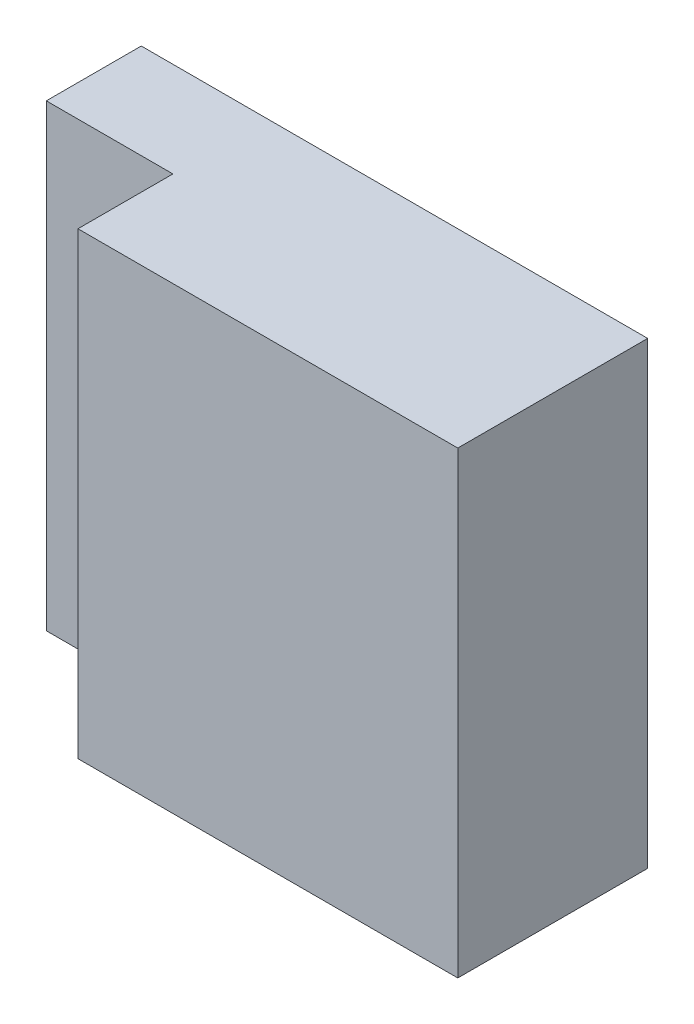
ISO-10303-21;
HEADER;
FILE_DESCRIPTION(('STEP AP214'),'2;1');
FILE_NAME('part.step','',(''),(''),'','','');
FILE_SCHEMA(('AUTOMOTIVE_DESIGN { 1 0 10303 214 1 1 1 1 }'));
ENDSEC;
DATA;
#1=APPLICATION_CONTEXT('core data for automotive mechanical design processes');
#2=APPLICATION_PROTOCOL_DEFINITION('international standard','automotive_design',2000,#1);
#3=PRODUCT_CONTEXT('',#1,'mechanical');
#4=PRODUCT('Part','Part','',(#3));
#5=PRODUCT_RELATED_PRODUCT_CATEGORY('part','',(#4));
#6=PRODUCT_DEFINITION_FORMATION('','',#4);
#7=PRODUCT_DEFINITION_CONTEXT('part definition',#1,'design');
#8=PRODUCT_DEFINITION('design','',#6,#7);
#9=PRODUCT_DEFINITION_SHAPE('','',#8);
#10=(LENGTH_UNIT() NAMED_UNIT(*) SI_UNIT(.MILLI.,.METRE.));
#11=(NAMED_UNIT(*) PLANE_ANGLE_UNIT() SI_UNIT($,.RADIAN.));
#12=(NAMED_UNIT(*) SI_UNIT($,.STERADIAN.) SOLID_ANGLE_UNIT());
#13=UNCERTAINTY_MEASURE_WITH_UNIT(LENGTH_MEASURE(1.E-05),#10,'distance_accuracy_value','');
#14=(GEOMETRIC_REPRESENTATION_CONTEXT(3) GLOBAL_UNCERTAINTY_ASSIGNED_CONTEXT((#13)) GLOBAL_UNIT_ASSIGNED_CONTEXT((#10,
#11,#12)) REPRESENTATION_CONTEXT('',''));
#15=CARTESIAN_POINT('',(0.,0.,0.));
#16=DIRECTION('',(0.,0.,1.));
#17=DIRECTION('',(1.,0.,0.));
#18=AXIS2_PLACEMENT_3D('',#15,#16,#17);
#19=CARTESIAN_POINT('',(0.7,0.,0.65));
#20=DIRECTION('',(1.,0.,0.));
#21=DIRECTION('',(0.,0.,-1.));
#22=AXIS2_PLACEMENT_3D('',#19,#20,#21);
#23=PLANE('',#22);
#24=DIRECTION('',(0.,0.,-1.));
#25=VECTOR('',#24,1.);
#26=CARTESIAN_POINT('',(0.7,1.450000047684,0.65));
#27=LINE('',#26,#25);
#28=CARTESIAN_POINT('',(0.7,1.450000047684,0.65000000447025));
#29=VERTEX_POINT('',#28);
#30=CARTESIAN_POINT('',(0.7,1.450000047684,0.950000011921));
#31=VERTEX_POINT('',#30);
#32=EDGE_CURVE('E71',#29,#31,#27,.F.);
#33=ORIENTED_EDGE('',*,*,#32,.F.);
#34=DIRECTION('',(0.,1.,0.));
#35=VECTOR('',#34,1.);
#36=CARTESIAN_POINT('',(0.7,0.,0.650000011921));
#37=LINE('',#36,#35);
#38=CARTESIAN_POINT('',(0.7,0.,0.65000000447025));
#39=VERTEX_POINT('',#38);
#40=EDGE_CURVE('E72',#39,#29,#37,.T.);
#41=ORIENTED_EDGE('',*,*,#40,.F.);
#42=DIRECTION('',(0.,0.,-1.));
#43=VECTOR('',#42,1.);
#44=CARTESIAN_POINT('',(0.7,0.,0.65));
#45=LINE('',#44,#43);
#46=CARTESIAN_POINT('',(0.7,0.,0.950000011921));
#47=VERTEX_POINT('',#46);
#48=EDGE_CURVE('E19',#47,#39,#45,.T.);
#49=ORIENTED_EDGE('',*,*,#48,.F.);
#50=DIRECTION('',(0.,1.,0.));
#51=VECTOR('',#50,1.);
#52=CARTESIAN_POINT('',(0.7,0.,0.950000011921));
#53=LINE('',#52,#51);
#54=EDGE_CURVE('E74',#31,#47,#53,.F.);
#55=ORIENTED_EDGE('',*,*,#54,.F.);
#56=EDGE_LOOP('',(#33,#41,#49,#55));
#57=FACE_BOUND('',#56,.T.);
#58=ADVANCED_FACE('F16',(#57),#23,.F.);
#59=CARTESIAN_POINT('',(0.7,0.,0.950000011921));
#60=DIRECTION('',(0.,0.,1.));
#61=DIRECTION('',(1.,0.,0.));
#62=AXIS2_PLACEMENT_3D('',#59,#60,#61);
#63=PLANE('',#62);
#64=DIRECTION('',(0.,1.,0.));
#65=VECTOR('',#64,1.);
#66=CARTESIAN_POINT('',(1.900000047684,0.,0.950000011921));
#67=LINE('',#66,#65);
#68=CARTESIAN_POINT('',(1.900000047684,1.450000047684,0.950000011921));
#69=VERTEX_POINT('',#68);
#70=CARTESIAN_POINT('',(1.900000047684,0.,0.950000011921));
#71=VERTEX_POINT('',#70);
#72=EDGE_CURVE('E92',#69,#71,#67,.F.);
#73=ORIENTED_EDGE('',*,*,#72,.F.);
#74=DIRECTION('',(1.,0.,0.));
#75=VECTOR('',#74,1.);
#76=CARTESIAN_POINT('',(0.7,1.450000047684,0.950000011921));
#77=LINE('',#76,#75);
#78=EDGE_CURVE('E95',#31,#69,#77,.T.);
#79=ORIENTED_EDGE('',*,*,#78,.F.);
#80=ORIENTED_EDGE('',*,*,#54,.T.);
#81=DIRECTION('',(1.,0.,0.));
#82=VECTOR('',#81,1.);
#83=CARTESIAN_POINT('',(0.7,0.,0.950000011921));
#84=LINE('',#83,#82);
#85=EDGE_CURVE('E80',#47,#71,#84,.T.);
#86=ORIENTED_EDGE('',*,*,#85,.T.);
#87=EDGE_LOOP('',(#73,#79,#80,#86));
#88=FACE_BOUND('',#87,.T.);
#89=ADVANCED_FACE('F132',(#88),#63,.T.);
#90=CARTESIAN_POINT('',(0.3,0.,0.650000011921));
#91=DIRECTION('',(0.,0.,1.));
#92=DIRECTION('',(1.,0.,0.));
#93=AXIS2_PLACEMENT_3D('',#90,#91,#92);
#94=PLANE('',#93);
#95=DIRECTION('',(1.,0.,0.));
#96=VECTOR('',#95,1.);
#97=CARTESIAN_POINT('',(0.3,0.,0.650000011921));
#98=LINE('',#97,#96);
#99=CARTESIAN_POINT('',(0.3,0.,0.650000011921));
#100=VERTEX_POINT('',#99);
#101=EDGE_CURVE('E65',#100,#39,#98,.T.);
#102=ORIENTED_EDGE('',*,*,#101,.T.);
#103=ORIENTED_EDGE('',*,*,#40,.T.);
#104=DIRECTION('',(1.,0.,0.));
#105=VECTOR('',#104,1.);
#106=CARTESIAN_POINT('',(0.3,1.450000047684,0.650000011921));
#107=LINE('',#106,#105);
#108=CARTESIAN_POINT('',(0.3,1.450000047684,0.650000011921));
#109=VERTEX_POINT('',#108);
#110=EDGE_CURVE('E78',#29,#109,#107,.F.);
#111=ORIENTED_EDGE('',*,*,#110,.T.);
#112=DIRECTION('',(0.,1.,0.));
#113=VECTOR('',#112,1.);
#114=CARTESIAN_POINT('',(0.3,0.,0.650000011921));
#115=LINE('',#114,#113);
#116=EDGE_CURVE('E97',#109,#100,#115,.F.);
#117=ORIENTED_EDGE('',*,*,#116,.T.);
#118=EDGE_LOOP('',(#102,#103,#111,#117));
#119=FACE_BOUND('',#118,.T.);
#120=ADVANCED_FACE('F77',(#119),#94,.T.);
#121=CARTESIAN_POINT('',(0.3,0.,0.35));
#122=DIRECTION('',(1.,0.,0.));
#123=DIRECTION('',(0.,0.,-1.));
#124=AXIS2_PLACEMENT_3D('',#121,#122,#123);
#125=PLANE('',#124);
#126=DIRECTION('',(0.,0.,1.));
#127=VECTOR('',#126,1.);
#128=CARTESIAN_POINT('',(0.3,1.450000047684,0.35));
#129=LINE('',#128,#127);
#130=CARTESIAN_POINT('',(0.3,1.450000047684,0.35));
#131=VERTEX_POINT('',#130);
#132=EDGE_CURVE('E85',#131,#109,#129,.T.);
#133=ORIENTED_EDGE('',*,*,#132,.F.);
#134=DIRECTION('',(0.,1.,0.));
#135=VECTOR('',#134,1.);
#136=CARTESIAN_POINT('',(0.3,0.,0.35));
#137=LINE('',#136,#135);
#138=CARTESIAN_POINT('',(0.3,0.,0.35));
#139=VERTEX_POINT('',#138);
#140=EDGE_CURVE('E106',#131,#139,#137,.F.);
#141=ORIENTED_EDGE('',*,*,#140,.T.);
#142=DIRECTION('',(0.,0.,1.));
#143=VECTOR('',#142,1.);
#144=CARTESIAN_POINT('',(0.3,0.,0.35));
#145=LINE('',#144,#143);
#146=EDGE_CURVE('E99',#139,#100,#145,.T.);
#147=ORIENTED_EDGE('',*,*,#146,.T.);
#148=ORIENTED_EDGE('',*,*,#116,.F.);
#149=EDGE_LOOP('',(#133,#141,#147,#148));
#150=FACE_BOUND('',#149,.T.);
#151=ADVANCED_FACE('F123',(#150),#125,.F.);
#152=CARTESIAN_POINT('',(0.3,0.,0.35));
#153=DIRECTION('',(0.,1.,0.));
#154=DIRECTION('',(0.,0.,1.));
#155=AXIS2_PLACEMENT_3D('',#152,#153,#154);
#156=PLANE('',#155);
#157=DIRECTION('',(0.,0.,-1.));
#158=VECTOR('',#157,1.);
#159=CARTESIAN_POINT('',(1.900000023842,0.,0.35));
#160=LINE('',#159,#158);
#161=CARTESIAN_POINT('',(1.9000000298025,0.,0.35));
#162=VERTEX_POINT('',#161);
#163=EDGE_CURVE('E102',#71,#162,#160,.T.);
#164=ORIENTED_EDGE('',*,*,#163,.F.);
#165=ORIENTED_EDGE('',*,*,#85,.F.);
#166=ORIENTED_EDGE('',*,*,#48,.T.);
#167=ORIENTED_EDGE('',*,*,#101,.F.);
#168=ORIENTED_EDGE('',*,*,#146,.F.);
#169=DIRECTION('',(1.,0.,0.));
#170=VECTOR('',#169,1.);
#171=CARTESIAN_POINT('',(0.3,0.,0.35));
#172=LINE('',#171,#170);
#173=EDGE_CURVE('E109',#139,#162,#172,.T.);
#174=ORIENTED_EDGE('',*,*,#173,.T.);
#175=EDGE_LOOP('',(#164,#165,#166,#167,#168,#174));
#176=FACE_BOUND('',#175,.T.);
#177=ADVANCED_FACE('F120',(#176),#156,.F.);
#178=CARTESIAN_POINT('',(1.900000023842,0.,0.35));
#179=DIRECTION('',(1.,0.,0.));
#180=DIRECTION('',(0.,0.,-1.));
#181=AXIS2_PLACEMENT_3D('',#178,#179,#180);
#182=PLANE('',#181);
#183=DIRECTION('',(0.,0.,1.));
#184=VECTOR('',#183,1.);
#185=CARTESIAN_POINT('',(1.900000035763,1.450000047684,0.35));
#186=LINE('',#185,#184);
#187=CARTESIAN_POINT('',(1.90000002682225,1.450000047684,0.35));
#188=VERTEX_POINT('',#187);
#189=EDGE_CURVE('E33',#69,#188,#186,.F.);
#190=ORIENTED_EDGE('',*,*,#189,.F.);
#191=ORIENTED_EDGE('',*,*,#72,.T.);
#192=ORIENTED_EDGE('',*,*,#163,.T.);
#193=DIRECTION('',(0.,1.,0.));
#194=VECTOR('',#193,1.);
#195=CARTESIAN_POINT('',(1.900000023842,0.,0.35));
#196=LINE('',#195,#194);
#197=EDGE_CURVE('E25',#162,#188,#196,.T.);
#198=ORIENTED_EDGE('',*,*,#197,.T.);
#199=EDGE_LOOP('',(#190,#191,#192,#198));
#200=FACE_BOUND('',#199,.T.);
#201=ADVANCED_FACE('F115',(#200),#182,.T.);
#202=CARTESIAN_POINT('',(0.3,1.450000047684,0.35));
#203=DIRECTION('',(0.,1.,0.));
#204=DIRECTION('',(0.,0.,1.));
#205=AXIS2_PLACEMENT_3D('',#202,#203,#204);
#206=PLANE('',#205);
#207=ORIENTED_EDGE('',*,*,#110,.F.);
#208=ORIENTED_EDGE('',*,*,#32,.T.);
#209=ORIENTED_EDGE('',*,*,#78,.T.);
#210=ORIENTED_EDGE('',*,*,#189,.T.);
#211=DIRECTION('',(1.,0.,0.));
#212=VECTOR('',#211,1.);
#213=CARTESIAN_POINT('',(0.3,1.450000047684,0.35));
#214=LINE('',#213,#212);
#215=EDGE_CURVE('E10',#188,#131,#214,.F.);
#216=ORIENTED_EDGE('',*,*,#215,.T.);
#217=ORIENTED_EDGE('',*,*,#132,.T.);
#218=EDGE_LOOP('',(#207,#208,#209,#210,#216,#217));
#219=FACE_BOUND('',#218,.T.);
#220=ADVANCED_FACE('F83',(#219),#206,.T.);
#221=CARTESIAN_POINT('',(0.3,0.,0.35));
#222=DIRECTION('',(0.,0.,1.));
#223=DIRECTION('',(1.,0.,0.));
#224=AXIS2_PLACEMENT_3D('',#221,#222,#223);
#225=PLANE('',#224);
#226=ORIENTED_EDGE('',*,*,#197,.F.);
#227=ORIENTED_EDGE('',*,*,#173,.F.);
#228=ORIENTED_EDGE('',*,*,#140,.F.);
#229=ORIENTED_EDGE('',*,*,#215,.F.);
#230=EDGE_LOOP('',(#226,#227,#228,#229));
#231=FACE_BOUND('',#230,.T.);
#232=ADVANCED_FACE('F118',(#231),#225,.F.);
#233=CLOSED_SHELL('',(#58,#89,#120,#151,#177,#201,#220,#232));
#234=MANIFOLD_SOLID_BREP('B1',#233);
#235=ADVANCED_BREP_SHAPE_REPRESENTATION('',(#18,#234),#14);
#236=SHAPE_DEFINITION_REPRESENTATION(#9,#235);
ENDSEC;
END-ISO-10303-21;
